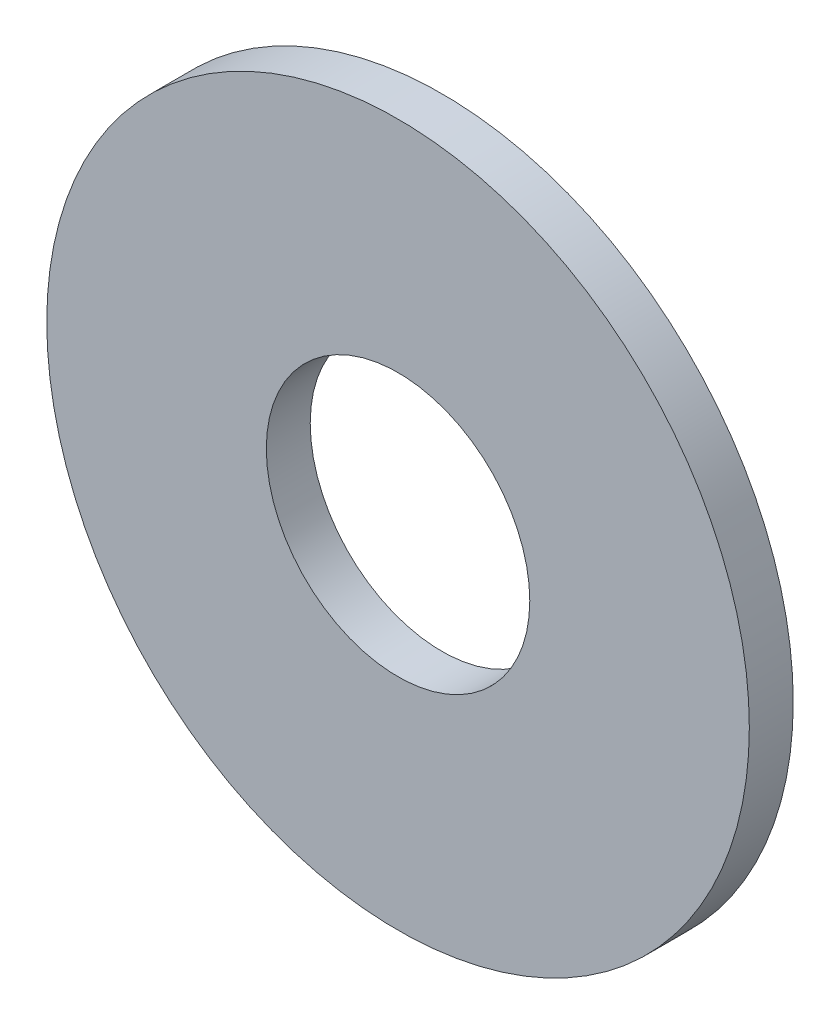
ISO-10303-21;
HEADER;
FILE_DESCRIPTION(('STEP AP214'),'2;1');
FILE_NAME('part.step','',(''),(''),'','','');
FILE_SCHEMA(('AUTOMOTIVE_DESIGN { 1 0 10303 214 1 1 1 1 }'));
ENDSEC;
DATA;
#1=APPLICATION_CONTEXT('core data for automotive mechanical design processes');
#2=APPLICATION_PROTOCOL_DEFINITION('international standard','automotive_design',2000,#1);
#3=PRODUCT_CONTEXT('',#1,'mechanical');
#4=PRODUCT('Part','Part','',(#3));
#5=PRODUCT_RELATED_PRODUCT_CATEGORY('part','',(#4));
#6=PRODUCT_DEFINITION_FORMATION('','',#4);
#7=PRODUCT_DEFINITION_CONTEXT('part definition',#1,'design');
#8=PRODUCT_DEFINITION('design','',#6,#7);
#9=PRODUCT_DEFINITION_SHAPE('','',#8);
#10=(LENGTH_UNIT() NAMED_UNIT(*) SI_UNIT(.MILLI.,.METRE.));
#11=(NAMED_UNIT(*) PLANE_ANGLE_UNIT() SI_UNIT($,.RADIAN.));
#12=(NAMED_UNIT(*) SI_UNIT($,.STERADIAN.) SOLID_ANGLE_UNIT());
#13=UNCERTAINTY_MEASURE_WITH_UNIT(LENGTH_MEASURE(1.E-05),#10,'distance_accuracy_value','');
#14=(GEOMETRIC_REPRESENTATION_CONTEXT(3) GLOBAL_UNCERTAINTY_ASSIGNED_CONTEXT((#13)) GLOBAL_UNIT_ASSIGNED_CONTEXT((#10,
#11,#12)) REPRESENTATION_CONTEXT('',''));
#15=CARTESIAN_POINT('',(0.,0.,0.));
#16=DIRECTION('',(0.,0.,1.));
#17=DIRECTION('',(1.,0.,0.));
#18=AXIS2_PLACEMENT_3D('',#15,#16,#17);
#19=CARTESIAN_POINT('',(0.,0.,1.));
#20=DIRECTION('',(0.,0.,1.));
#21=DIRECTION('',(1.,0.,0.));
#22=AXIS2_PLACEMENT_3D('',#19,#20,#21);
#23=PLANE('',#22);
#24=CARTESIAN_POINT('',(0.,0.,1.));
#25=DIRECTION('',(0.,0.,1.));
#26=DIRECTION('',(1.,0.,0.));
#27=AXIS2_PLACEMENT_3D('',#24,#25,#26);
#28=CIRCLE('',#27,8.);
#29=CARTESIAN_POINT('',(8.,0.,1.));
#30=VERTEX_POINT('',#29);
#31=EDGE_CURVE('E10',#30,#30,#28,.T.);
#32=ORIENTED_EDGE('',*,*,#31,.T.);
#33=EDGE_LOOP('',(#32));
#34=FACE_BOUND('',#33,.T.);
#35=CARTESIAN_POINT('',(0.,0.,1.));
#36=DIRECTION('',(0.,0.,1.));
#37=DIRECTION('',(1.,0.,0.));
#38=AXIS2_PLACEMENT_3D('',#35,#36,#37);
#39=CIRCLE('',#38,3.);
#40=CARTESIAN_POINT('',(3.,0.,1.));
#41=VERTEX_POINT('',#40);
#42=EDGE_CURVE('E56',#41,#41,#39,.T.);
#43=ORIENTED_EDGE('',*,*,#42,.F.);
#44=EDGE_LOOP('',(#43));
#45=FACE_BOUND('',#44,.T.);
#46=ADVANCED_FACE('F43',(#34,#45),#23,.T.);
#47=CARTESIAN_POINT('',(0.,0.,0.));
#48=DIRECTION('',(0.,0.,1.));
#49=DIRECTION('',(1.,0.,0.));
#50=AXIS2_PLACEMENT_3D('',#47,#48,#49);
#51=PLANE('',#50);
#52=CARTESIAN_POINT('',(0.,0.,0.));
#53=DIRECTION('',(0.,0.,1.));
#54=DIRECTION('',(1.,0.,0.));
#55=AXIS2_PLACEMENT_3D('',#52,#53,#54);
#56=CIRCLE('',#55,8.);
#57=CARTESIAN_POINT('',(8.,0.,0.));
#58=VERTEX_POINT('',#57);
#59=EDGE_CURVE('E47',#58,#58,#56,.T.);
#60=ORIENTED_EDGE('',*,*,#59,.F.);
#61=EDGE_LOOP('',(#60));
#62=FACE_BOUND('',#61,.T.);
#63=CARTESIAN_POINT('',(0.,0.,0.));
#64=DIRECTION('',(0.,0.,1.));
#65=DIRECTION('',(1.,0.,0.));
#66=AXIS2_PLACEMENT_3D('',#63,#64,#65);
#67=CIRCLE('',#66,3.);
#68=CARTESIAN_POINT('',(3.,0.,0.));
#69=VERTEX_POINT('',#68);
#70=EDGE_CURVE('E58',#69,#69,#67,.T.);
#71=ORIENTED_EDGE('',*,*,#70,.T.);
#72=EDGE_LOOP('',(#71));
#73=FACE_BOUND('',#72,.T.);
#74=ADVANCED_FACE('F70',(#62,#73),#51,.F.);
#75=CARTESIAN_POINT('',(0.,0.,1.));
#76=DIRECTION('',(0.,0.,-1.));
#77=DIRECTION('',(-1.,0.,0.));
#78=AXIS2_PLACEMENT_3D('',#75,#76,#77);
#79=CYLINDRICAL_SURFACE('',#78,8.);
#80=ORIENTED_EDGE('',*,*,#31,.F.);
#81=EDGE_LOOP('',(#80));
#82=FACE_BOUND('',#81,.T.);
#83=ORIENTED_EDGE('',*,*,#59,.T.);
#84=EDGE_LOOP('',(#83));
#85=FACE_BOUND('',#84,.T.);
#86=ADVANCED_FACE('F45',(#82,#85),#79,.T.);
#87=CARTESIAN_POINT('',(0.,0.,1.));
#88=DIRECTION('',(0.,0.,-1.));
#89=DIRECTION('',(-1.,0.,0.));
#90=AXIS2_PLACEMENT_3D('',#87,#88,#89);
#91=CYLINDRICAL_SURFACE('',#90,3.);
#92=ORIENTED_EDGE('',*,*,#42,.T.);
#93=EDGE_LOOP('',(#92));
#94=FACE_BOUND('',#93,.T.);
#95=ORIENTED_EDGE('',*,*,#70,.F.);
#96=EDGE_LOOP('',(#95));
#97=FACE_BOUND('',#96,.T.);
#98=ADVANCED_FACE('F66',(#94,#97),#91,.F.);
#99=CLOSED_SHELL('',(#46,#74,#86,#98));
#100=MANIFOLD_SOLID_BREP('B2',#99);
#101=ADVANCED_BREP_SHAPE_REPRESENTATION('',(#18,#100),#14);
#102=SHAPE_DEFINITION_REPRESENTATION(#9,#101);
ENDSEC;
END-ISO-10303-21;
